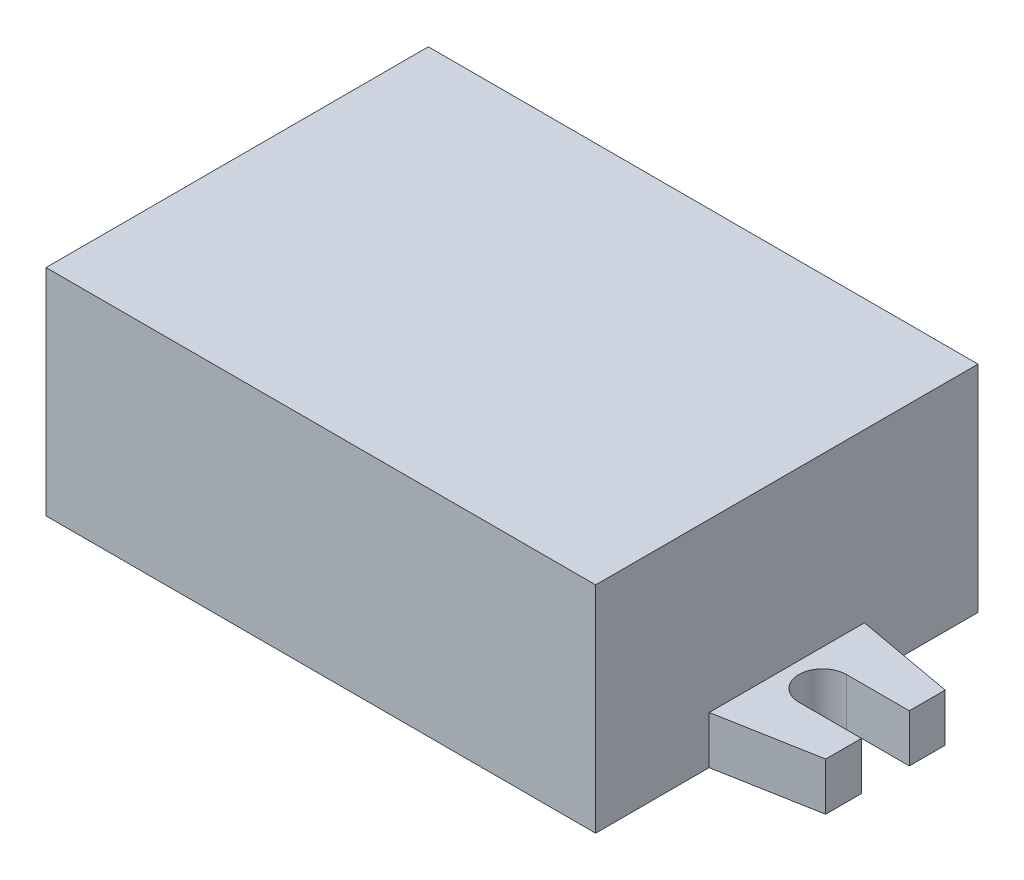
ISO-10303-21;
HEADER;
FILE_DESCRIPTION(('STEP AP214'),'2;1');
FILE_NAME('part.step','',(''),(''),'','','');
FILE_SCHEMA(('AUTOMOTIVE_DESIGN { 1 0 10303 214 1 1 1 1 }'));
ENDSEC;
DATA;
#1=APPLICATION_CONTEXT('core data for automotive mechanical design processes');
#2=APPLICATION_PROTOCOL_DEFINITION('international standard','automotive_design',2000,#1);
#3=PRODUCT_CONTEXT('',#1,'mechanical');
#4=PRODUCT('Part','Part','',(#3));
#5=PRODUCT_RELATED_PRODUCT_CATEGORY('part','',(#4));
#6=PRODUCT_DEFINITION_FORMATION('','',#4);
#7=PRODUCT_DEFINITION_CONTEXT('part definition',#1,'design');
#8=PRODUCT_DEFINITION('design','',#6,#7);
#9=PRODUCT_DEFINITION_SHAPE('','',#8);
#10=(LENGTH_UNIT() NAMED_UNIT(*) SI_UNIT(.MILLI.,.METRE.));
#11=(NAMED_UNIT(*) PLANE_ANGLE_UNIT() SI_UNIT($,.RADIAN.));
#12=(NAMED_UNIT(*) SI_UNIT($,.STERADIAN.) SOLID_ANGLE_UNIT());
#13=UNCERTAINTY_MEASURE_WITH_UNIT(LENGTH_MEASURE(1.E-05),#10,'distance_accuracy_value','');
#14=(GEOMETRIC_REPRESENTATION_CONTEXT(3) GLOBAL_UNCERTAINTY_ASSIGNED_CONTEXT((#13)) GLOBAL_UNIT_ASSIGNED_CONTEXT((#10,
#11,#12)) REPRESENTATION_CONTEXT('',''));
#15=CARTESIAN_POINT('',(0.,0.,0.));
#16=DIRECTION('',(0.,0.,1.));
#17=DIRECTION('',(1.,0.,0.));
#18=AXIS2_PLACEMENT_3D('',#15,#16,#17);
#19=CARTESIAN_POINT('',(-23.,18.,-16.));
#20=DIRECTION('',(1.,0.,0.));
#21=DIRECTION('',(0.,0.,-1.));
#22=AXIS2_PLACEMENT_3D('',#19,#20,#21);
#23=PLANE('',#22);
#24=DIRECTION('',(0.,-1.,0.));
#25=VECTOR('',#24,1.);
#26=CARTESIAN_POINT('',(-23.,4.,-6.5));
#27=LINE('',#26,#25);
#28=CARTESIAN_POINT('',(-23.,4.,-6.5));
#29=VERTEX_POINT('',#28);
#30=CARTESIAN_POINT('',(-23.,0.,-6.5));
#31=VERTEX_POINT('',#30);
#32=EDGE_CURVE('E308',#29,#31,#27,.T.);
#33=ORIENTED_EDGE('',*,*,#32,.F.);
#34=DIRECTION('',(0.,0.,1.));
#35=VECTOR('',#34,1.);
#36=CARTESIAN_POINT('',(-23.,4.,6.5));
#37=LINE('',#36,#35);
#38=CARTESIAN_POINT('',(-23.,4.,6.5));
#39=VERTEX_POINT('',#38);
#40=EDGE_CURVE('E278',#29,#39,#37,.T.);
#41=ORIENTED_EDGE('',*,*,#40,.T.);
#42=DIRECTION('',(0.,-1.,0.));
#43=VECTOR('',#42,1.);
#44=CARTESIAN_POINT('',(-23.,4.,6.5));
#45=LINE('',#44,#43);
#46=CARTESIAN_POINT('',(-23.,0.,6.5));
#47=VERTEX_POINT('',#46);
#48=EDGE_CURVE('E306',#39,#47,#45,.T.);
#49=ORIENTED_EDGE('',*,*,#48,.T.);
#50=DIRECTION('',(0.,0.,1.));
#51=VECTOR('',#50,1.);
#52=CARTESIAN_POINT('',(-23.,0.,-16.));
#53=LINE('',#52,#51);
#54=CARTESIAN_POINT('',(-23.,0.,16.));
#55=VERTEX_POINT('',#54);
#56=EDGE_CURVE('E330',#47,#55,#53,.T.);
#57=ORIENTED_EDGE('',*,*,#56,.T.);
#58=DIRECTION('',(0.,-1.,0.));
#59=VECTOR('',#58,1.);
#60=CARTESIAN_POINT('',(-23.,18.,16.));
#61=LINE('',#60,#59);
#62=CARTESIAN_POINT('',(-23.,18.,16.));
#63=VERTEX_POINT('',#62);
#64=EDGE_CURVE('E51',#63,#55,#61,.T.);
#65=ORIENTED_EDGE('',*,*,#64,.F.);
#66=DIRECTION('',(0.,0.,1.));
#67=VECTOR('',#66,1.);
#68=CARTESIAN_POINT('',(-23.,18.,-16.));
#69=LINE('',#68,#67);
#70=CARTESIAN_POINT('',(-23.,18.,-16.));
#71=VERTEX_POINT('',#70);
#72=EDGE_CURVE('E324',#71,#63,#69,.T.);
#73=ORIENTED_EDGE('',*,*,#72,.F.);
#74=DIRECTION('',(0.,-1.,0.));
#75=VECTOR('',#74,1.);
#76=CARTESIAN_POINT('',(-23.,18.,-16.));
#77=LINE('',#76,#75);
#78=CARTESIAN_POINT('',(-23.,0.,-16.));
#79=VERTEX_POINT('',#78);
#80=EDGE_CURVE('E11',#71,#79,#77,.T.);
#81=ORIENTED_EDGE('',*,*,#80,.T.);
#82=EDGE_CURVE('E322',#79,#31,#53,.T.);
#83=ORIENTED_EDGE('',*,*,#82,.T.);
#84=EDGE_LOOP('',(#33,#41,#49,#57,#65,#73,#81,#83));
#85=FACE_BOUND('',#84,.T.);
#86=ADVANCED_FACE('F43',(#85),#23,.F.);
#87=CARTESIAN_POINT('',(-23.,18.,16.));
#88=DIRECTION('',(0.,0.,-1.));
#89=DIRECTION('',(-1.,0.,0.));
#90=AXIS2_PLACEMENT_3D('',#87,#88,#89);
#91=PLANE('',#90);
#92=DIRECTION('',(1.,0.,0.));
#93=VECTOR('',#92,1.);
#94=CARTESIAN_POINT('',(-23.,0.,16.));
#95=LINE('',#94,#93);
#96=CARTESIAN_POINT('',(23.,0.,16.));
#97=VERTEX_POINT('',#96);
#98=EDGE_CURVE('E305',#55,#97,#95,.T.);
#99=ORIENTED_EDGE('',*,*,#98,.T.);
#100=DIRECTION('',(0.,-1.,0.));
#101=VECTOR('',#100,1.);
#102=CARTESIAN_POINT('',(23.,18.,16.));
#103=LINE('',#102,#101);
#104=CARTESIAN_POINT('',(23.,18.,16.));
#105=VERTEX_POINT('',#104);
#106=EDGE_CURVE('E256',#105,#97,#103,.T.);
#107=ORIENTED_EDGE('',*,*,#106,.F.);
#108=DIRECTION('',(1.,0.,0.));
#109=VECTOR('',#108,1.);
#110=CARTESIAN_POINT('',(-23.,18.,16.));
#111=LINE('',#110,#109);
#112=EDGE_CURVE('E319',#63,#105,#111,.T.);
#113=ORIENTED_EDGE('',*,*,#112,.F.);
#114=ORIENTED_EDGE('',*,*,#64,.T.);
#115=EDGE_LOOP('',(#99,#107,#113,#114));
#116=FACE_BOUND('',#115,.T.);
#117=ADVANCED_FACE('F45',(#116),#91,.F.);
#118=CARTESIAN_POINT('',(0.,18.,-16.));
#119=DIRECTION('',(0.,0.,1.));
#120=DIRECTION('',(1.,0.,0.));
#121=AXIS2_PLACEMENT_3D('',#118,#119,#120);
#122=PLANE('',#121);
#123=DIRECTION('',(-1.,0.,0.));
#124=VECTOR('',#123,1.);
#125=CARTESIAN_POINT('',(0.,0.,-16.));
#126=LINE('',#125,#124);
#127=CARTESIAN_POINT('',(23.,0.,-16.));
#128=VERTEX_POINT('',#127);
#129=EDGE_CURVE('E328',#128,#79,#126,.T.);
#130=ORIENTED_EDGE('',*,*,#129,.T.);
#131=ORIENTED_EDGE('',*,*,#80,.F.);
#132=DIRECTION('',(-1.,0.,0.));
#133=VECTOR('',#132,1.);
#134=CARTESIAN_POINT('',(0.,18.,-16.));
#135=LINE('',#134,#133);
#136=CARTESIAN_POINT('',(23.,18.,-16.));
#137=VERTEX_POINT('',#136);
#138=EDGE_CURVE('E321',#137,#71,#135,.T.);
#139=ORIENTED_EDGE('',*,*,#138,.F.);
#140=DIRECTION('',(0.,-1.,0.));
#141=VECTOR('',#140,1.);
#142=CARTESIAN_POINT('',(23.,18.,-16.));
#143=LINE('',#142,#141);
#144=EDGE_CURVE('E250',#137,#128,#143,.T.);
#145=ORIENTED_EDGE('',*,*,#144,.T.);
#146=EDGE_LOOP('',(#130,#131,#139,#145));
#147=FACE_BOUND('',#146,.T.);
#148=ADVANCED_FACE('F397',(#147),#122,.F.);
#149=CARTESIAN_POINT('',(0.,18.,0.));
#150=DIRECTION('',(0.,1.,0.));
#151=DIRECTION('',(0.,0.,1.));
#152=AXIS2_PLACEMENT_3D('',#149,#150,#151);
#153=PLANE('',#152);
#154=ORIENTED_EDGE('',*,*,#112,.T.);
#155=DIRECTION('',(0.,0.,1.));
#156=VECTOR('',#155,1.);
#157=CARTESIAN_POINT('',(23.,18.,-16.));
#158=LINE('',#157,#156);
#159=EDGE_CURVE('E247',#137,#105,#158,.T.);
#160=ORIENTED_EDGE('',*,*,#159,.F.);
#161=ORIENTED_EDGE('',*,*,#138,.T.);
#162=ORIENTED_EDGE('',*,*,#72,.T.);
#163=EDGE_LOOP('',(#154,#160,#161,#162));
#164=FACE_BOUND('',#163,.T.);
#165=ADVANCED_FACE('F350',(#164),#153,.T.);
#166=CARTESIAN_POINT('',(0.,0.,0.));
#167=DIRECTION('',(0.,1.,0.));
#168=DIRECTION('',(0.,0.,1.));
#169=AXIS2_PLACEMENT_3D('',#166,#167,#168);
#170=PLANE('',#169);
#171=ORIENTED_EDGE('',*,*,#98,.F.);
#172=ORIENTED_EDGE('',*,*,#56,.F.);
#173=DIRECTION('',(-0.983869910099907,0.,-0.178885438199984));
#174=VECTOR('',#173,1.);
#175=CARTESIAN_POINT('',(-31.25,0.,5.));
#176=LINE('',#175,#174);
#177=CARTESIAN_POINT('',(-31.25,0.,5.));
#178=VERTEX_POINT('',#177);
#179=EDGE_CURVE('E66',#47,#178,#176,.T.);
#180=ORIENTED_EDGE('',*,*,#179,.T.);
#181=DIRECTION('',(0.,0.,-1.));
#182=VECTOR('',#181,1.);
#183=CARTESIAN_POINT('',(-31.25,0.,2.));
#184=LINE('',#183,#182);
#185=CARTESIAN_POINT('',(-31.25,0.,2.));
#186=VERTEX_POINT('',#185);
#187=EDGE_CURVE('E259',#178,#186,#184,.T.);
#188=ORIENTED_EDGE('',*,*,#187,.T.);
#189=DIRECTION('',(1.,0.,0.));
#190=VECTOR('',#189,1.);
#191=CARTESIAN_POINT('',(-31.25,0.,2.));
#192=LINE('',#191,#190);
#193=CARTESIAN_POINT('',(-26.,0.,1.99999999999999));
#194=VERTEX_POINT('',#193);
#195=EDGE_CURVE('E287',#186,#194,#192,.T.);
#196=ORIENTED_EDGE('',*,*,#195,.T.);
#197=CARTESIAN_POINT('',(-26.,0.,0.));
#198=DIRECTION('',(0.,1.,0.));
#199=DIRECTION('',(0.,0.,1.));
#200=AXIS2_PLACEMENT_3D('',#197,#198,#199);
#201=CIRCLE('',#200,2.);
#202=CARTESIAN_POINT('',(-26.,0.,-2.));
#203=VERTEX_POINT('',#202);
#204=EDGE_CURVE('E290',#194,#203,#201,.T.);
#205=ORIENTED_EDGE('',*,*,#204,.T.);
#206=DIRECTION('',(-1.,0.,0.));
#207=VECTOR('',#206,1.);
#208=CARTESIAN_POINT('',(-31.25,0.,-2.));
#209=LINE('',#208,#207);
#210=CARTESIAN_POINT('',(-31.25,0.,-2.));
#211=VERTEX_POINT('',#210);
#212=EDGE_CURVE('E293',#203,#211,#209,.T.);
#213=ORIENTED_EDGE('',*,*,#212,.T.);
#214=DIRECTION('',(0.,0.,-1.));
#215=VECTOR('',#214,1.);
#216=CARTESIAN_POINT('',(-31.25,0.,-5.));
#217=LINE('',#216,#215);
#218=CARTESIAN_POINT('',(-31.25,0.,-5.));
#219=VERTEX_POINT('',#218);
#220=EDGE_CURVE('E296',#211,#219,#217,.T.);
#221=ORIENTED_EDGE('',*,*,#220,.T.);
#222=DIRECTION('',(0.983869910099908,0.,-0.178885438199982));
#223=VECTOR('',#222,1.);
#224=CARTESIAN_POINT('',(-31.25,0.,-5.));
#225=LINE('',#224,#223);
#226=EDGE_CURVE('E299',#219,#31,#225,.T.);
#227=ORIENTED_EDGE('',*,*,#226,.T.);
#228=ORIENTED_EDGE('',*,*,#82,.F.);
#229=ORIENTED_EDGE('',*,*,#129,.F.);
#230=DIRECTION('',(0.,0.,1.));
#231=VECTOR('',#230,1.);
#232=CARTESIAN_POINT('',(23.,0.,-16.));
#233=LINE('',#232,#231);
#234=CARTESIAN_POINT('',(23.,0.,-6.5));
#235=VERTEX_POINT('',#234);
#236=EDGE_CURVE('E251',#128,#235,#233,.T.);
#237=ORIENTED_EDGE('',*,*,#236,.T.);
#238=DIRECTION('',(-0.983869910099908,0.,-0.178885438199982));
#239=VECTOR('',#238,1.);
#240=CARTESIAN_POINT('',(31.25,0.,-5.00000000000001));
#241=LINE('',#240,#239);
#242=CARTESIAN_POINT('',(31.25,0.,-5.00000000000001));
#243=VERTEX_POINT('',#242);
#244=EDGE_CURVE('E58',#243,#235,#241,.T.);
#245=ORIENTED_EDGE('',*,*,#244,.F.);
#246=DIRECTION('',(0.,0.,-1.));
#247=VECTOR('',#246,1.);
#248=CARTESIAN_POINT('',(31.25,0.,-5.00000000000001));
#249=LINE('',#248,#247);
#250=CARTESIAN_POINT('',(31.25,0.,-2.00000000000001));
#251=VERTEX_POINT('',#250);
#252=EDGE_CURVE('E226',#251,#243,#249,.T.);
#253=ORIENTED_EDGE('',*,*,#252,.F.);
#254=DIRECTION('',(1.,0.,0.));
#255=VECTOR('',#254,1.);
#256=CARTESIAN_POINT('',(31.25,0.,-2.00000000000001));
#257=LINE('',#256,#255);
#258=CARTESIAN_POINT('',(26.,0.,-2.00000000000001));
#259=VERTEX_POINT('',#258);
#260=EDGE_CURVE('E228',#259,#251,#257,.T.);
#261=ORIENTED_EDGE('',*,*,#260,.F.);
#262=CARTESIAN_POINT('',(26.,0.,0.));
#263=DIRECTION('',(0.,-1.,0.));
#264=DIRECTION('',(0.,0.,1.));
#265=AXIS2_PLACEMENT_3D('',#262,#263,#264);
#266=CIRCLE('',#265,2.);
#267=CARTESIAN_POINT('',(26.,0.,1.99999999999999));
#268=VERTEX_POINT('',#267);
#269=EDGE_CURVE('E209',#268,#259,#266,.T.);
#270=ORIENTED_EDGE('',*,*,#269,.F.);
#271=DIRECTION('',(-1.,0.,0.));
#272=VECTOR('',#271,1.);
#273=CARTESIAN_POINT('',(31.25,0.,1.99999999999999));
#274=LINE('',#273,#272);
#275=CARTESIAN_POINT('',(31.25,0.,1.99999999999999));
#276=VERTEX_POINT('',#275);
#277=EDGE_CURVE('E207',#276,#268,#274,.T.);
#278=ORIENTED_EDGE('',*,*,#277,.F.);
#279=DIRECTION('',(0.,0.,-1.));
#280=VECTOR('',#279,1.);
#281=CARTESIAN_POINT('',(31.25,0.,1.99999999999999));
#282=LINE('',#281,#280);
#283=CARTESIAN_POINT('',(31.25,0.,4.99999999999999));
#284=VERTEX_POINT('',#283);
#285=EDGE_CURVE('E222',#284,#276,#282,.T.);
#286=ORIENTED_EDGE('',*,*,#285,.F.);
#287=DIRECTION('',(0.983869910099907,0.,-0.178885438199984));
#288=VECTOR('',#287,1.);
#289=CARTESIAN_POINT('',(31.25,0.,4.99999999999999));
#290=LINE('',#289,#288);
#291=CARTESIAN_POINT('',(23.,0.,6.5));
#292=VERTEX_POINT('',#291);
#293=EDGE_CURVE('E197',#292,#284,#290,.T.);
#294=ORIENTED_EDGE('',*,*,#293,.F.);
#295=EDGE_CURVE('E232',#292,#97,#233,.T.);
#296=ORIENTED_EDGE('',*,*,#295,.T.);
#297=EDGE_LOOP('',(#171,#172,#180,#188,#196,#205,#213,#221,#227,#228,#229,#237,#245,#253,#261,
#270,#278,#286,#294,#296));
#298=FACE_BOUND('',#297,.T.);
#299=ADVANCED_FACE('F342',(#298),#170,.F.);
#300=CARTESIAN_POINT('',(-31.25,4.,2.));
#301=DIRECTION('',(-1.,0.,0.));
#302=DIRECTION('',(0.,0.,1.));
#303=AXIS2_PLACEMENT_3D('',#300,#301,#302);
#304=PLANE('',#303);
#305=ORIENTED_EDGE('',*,*,#187,.F.);
#306=DIRECTION('',(0.,-1.,0.));
#307=VECTOR('',#306,1.);
#308=CARTESIAN_POINT('',(-31.25,4.,5.));
#309=LINE('',#308,#307);
#310=CARTESIAN_POINT('',(-31.25,4.,5.));
#311=VERTEX_POINT('',#310);
#312=EDGE_CURVE('E303',#311,#178,#309,.T.);
#313=ORIENTED_EDGE('',*,*,#312,.F.);
#314=DIRECTION('',(0.,0.,-1.));
#315=VECTOR('',#314,1.);
#316=CARTESIAN_POINT('',(-31.25,4.,2.));
#317=LINE('',#316,#315);
#318=CARTESIAN_POINT('',(-31.25,4.,2.));
#319=VERTEX_POINT('',#318);
#320=EDGE_CURVE('E260',#311,#319,#317,.T.);
#321=ORIENTED_EDGE('',*,*,#320,.T.);
#322=DIRECTION('',(0.,-1.,0.));
#323=VECTOR('',#322,1.);
#324=CARTESIAN_POINT('',(-31.25,4.,2.));
#325=LINE('',#324,#323);
#326=EDGE_CURVE('E284',#319,#186,#325,.T.);
#327=ORIENTED_EDGE('',*,*,#326,.T.);
#328=EDGE_LOOP('',(#305,#313,#321,#327));
#329=FACE_BOUND('',#328,.T.);
#330=ADVANCED_FACE('F369',(#329),#304,.T.);
#331=CARTESIAN_POINT('',(-31.25,4.,5.));
#332=DIRECTION('',(-0.178885438199984,0.,0.983869910099907));
#333=DIRECTION('',(0.983869910099907,0.,0.178885438199984));
#334=AXIS2_PLACEMENT_3D('',#331,#332,#333);
#335=PLANE('',#334);
#336=ORIENTED_EDGE('',*,*,#179,.F.);
#337=ORIENTED_EDGE('',*,*,#48,.F.);
#338=DIRECTION('',(-0.983869910099907,0.,-0.178885438199984));
#339=VECTOR('',#338,1.);
#340=CARTESIAN_POINT('',(-31.25,4.,5.));
#341=LINE('',#340,#339);
#342=EDGE_CURVE('E281',#39,#311,#341,.T.);
#343=ORIENTED_EDGE('',*,*,#342,.T.);
#344=ORIENTED_EDGE('',*,*,#312,.T.);
#345=EDGE_LOOP('',(#336,#337,#343,#344));
#346=FACE_BOUND('',#345,.T.);
#347=ADVANCED_FACE('F366',(#346),#335,.T.);
#348=CARTESIAN_POINT('',(-31.25,4.,-5.));
#349=DIRECTION('',(-0.178885438199982,0.,-0.983869910099908));
#350=DIRECTION('',(-0.983869910099908,0.,0.178885438199982));
#351=AXIS2_PLACEMENT_3D('',#348,#349,#350);
#352=PLANE('',#351);
#353=ORIENTED_EDGE('',*,*,#226,.F.);
#354=DIRECTION('',(0.,-1.,0.));
#355=VECTOR('',#354,1.);
#356=CARTESIAN_POINT('',(-31.25,4.,-5.));
#357=LINE('',#356,#355);
#358=CARTESIAN_POINT('',(-31.25,4.,-5.));
#359=VERTEX_POINT('',#358);
#360=EDGE_CURVE('E310',#359,#219,#357,.T.);
#361=ORIENTED_EDGE('',*,*,#360,.F.);
#362=DIRECTION('',(0.983869910099908,0.,-0.178885438199982));
#363=VECTOR('',#362,1.);
#364=CARTESIAN_POINT('',(-31.25,4.,-5.));
#365=LINE('',#364,#363);
#366=EDGE_CURVE('E275',#359,#29,#365,.T.);
#367=ORIENTED_EDGE('',*,*,#366,.T.);
#368=ORIENTED_EDGE('',*,*,#32,.T.);
#369=EDGE_LOOP('',(#353,#361,#367,#368));
#370=FACE_BOUND('',#369,.T.);
#371=ADVANCED_FACE('F358',(#370),#352,.T.);
#372=CARTESIAN_POINT('',(-31.25,4.,-5.));
#373=DIRECTION('',(-1.,0.,0.));
#374=DIRECTION('',(0.,0.,1.));
#375=AXIS2_PLACEMENT_3D('',#372,#373,#374);
#376=PLANE('',#375);
#377=ORIENTED_EDGE('',*,*,#220,.F.);
#378=DIRECTION('',(0.,-1.,0.));
#379=VECTOR('',#378,1.);
#380=CARTESIAN_POINT('',(-31.25,4.,-2.));
#381=LINE('',#380,#379);
#382=CARTESIAN_POINT('',(-31.25,4.,-2.));
#383=VERTEX_POINT('',#382);
#384=EDGE_CURVE('E312',#383,#211,#381,.T.);
#385=ORIENTED_EDGE('',*,*,#384,.F.);
#386=DIRECTION('',(0.,0.,-1.));
#387=VECTOR('',#386,1.);
#388=CARTESIAN_POINT('',(-31.25,4.,-5.));
#389=LINE('',#388,#387);
#390=EDGE_CURVE('E272',#383,#359,#389,.T.);
#391=ORIENTED_EDGE('',*,*,#390,.T.);
#392=ORIENTED_EDGE('',*,*,#360,.T.);
#393=EDGE_LOOP('',(#377,#385,#391,#392));
#394=FACE_BOUND('',#393,.T.);
#395=ADVANCED_FACE('F382',(#394),#376,.T.);
#396=CARTESIAN_POINT('',(-31.25,4.,-2.));
#397=DIRECTION('',(0.,0.,1.));
#398=DIRECTION('',(1.,0.,0.));
#399=AXIS2_PLACEMENT_3D('',#396,#397,#398);
#400=PLANE('',#399);
#401=ORIENTED_EDGE('',*,*,#212,.F.);
#402=DIRECTION('',(0.,-1.,0.));
#403=VECTOR('',#402,1.);
#404=CARTESIAN_POINT('',(-26.,4.,-2.));
#405=LINE('',#404,#403);
#406=CARTESIAN_POINT('',(-26.,4.,-2.));
#407=VERTEX_POINT('',#406);
#408=EDGE_CURVE('E314',#407,#203,#405,.T.);
#409=ORIENTED_EDGE('',*,*,#408,.F.);
#410=DIRECTION('',(-1.,0.,0.));
#411=VECTOR('',#410,1.);
#412=CARTESIAN_POINT('',(-31.25,4.,-2.));
#413=LINE('',#412,#411);
#414=EDGE_CURVE('E269',#407,#383,#413,.T.);
#415=ORIENTED_EDGE('',*,*,#414,.T.);
#416=ORIENTED_EDGE('',*,*,#384,.T.);
#417=EDGE_LOOP('',(#401,#409,#415,#416));
#418=FACE_BOUND('',#417,.T.);
#419=ADVANCED_FACE('F380',(#418),#400,.T.);
#420=CARTESIAN_POINT('',(-26.,4.,0.));
#421=DIRECTION('',(0.,-1.,0.));
#422=DIRECTION('',(0.,0.,-1.));
#423=AXIS2_PLACEMENT_3D('',#420,#421,#422);
#424=CYLINDRICAL_SURFACE('',#423,2.);
#425=ORIENTED_EDGE('',*,*,#204,.F.);
#426=DIRECTION('',(0.,-1.,0.));
#427=VECTOR('',#426,1.);
#428=CARTESIAN_POINT('',(-26.,4.,1.99999999999999));
#429=LINE('',#428,#427);
#430=CARTESIAN_POINT('',(-26.,4.,1.99999999999999));
#431=VERTEX_POINT('',#430);
#432=EDGE_CURVE('E316',#431,#194,#429,.T.);
#433=ORIENTED_EDGE('',*,*,#432,.F.);
#434=CARTESIAN_POINT('',(-26.,4.,0.));
#435=DIRECTION('',(0.,1.,0.));
#436=DIRECTION('',(0.,0.,1.));
#437=AXIS2_PLACEMENT_3D('',#434,#435,#436);
#438=CIRCLE('',#437,2.);
#439=EDGE_CURVE('E266',#431,#407,#438,.T.);
#440=ORIENTED_EDGE('',*,*,#439,.T.);
#441=ORIENTED_EDGE('',*,*,#408,.T.);
#442=EDGE_LOOP('',(#425,#433,#440,#441));
#443=FACE_BOUND('',#442,.T.);
#444=ADVANCED_FACE('F376',(#443),#424,.F.);
#445=CARTESIAN_POINT('',(-31.25,4.,2.));
#446=DIRECTION('',(0.,0.,-1.));
#447=DIRECTION('',(-1.,0.,0.));
#448=AXIS2_PLACEMENT_3D('',#445,#446,#447);
#449=PLANE('',#448);
#450=ORIENTED_EDGE('',*,*,#195,.F.);
#451=ORIENTED_EDGE('',*,*,#326,.F.);
#452=DIRECTION('',(1.,0.,0.));
#453=VECTOR('',#452,1.);
#454=CARTESIAN_POINT('',(-31.25,4.,2.));
#455=LINE('',#454,#453);
#456=EDGE_CURVE('E263',#319,#431,#455,.T.);
#457=ORIENTED_EDGE('',*,*,#456,.T.);
#458=ORIENTED_EDGE('',*,*,#432,.T.);
#459=EDGE_LOOP('',(#450,#451,#457,#458));
#460=FACE_BOUND('',#459,.T.);
#461=ADVANCED_FACE('F373',(#460),#449,.T.);
#462=CARTESIAN_POINT('',(-26.,4.,0.));
#463=DIRECTION('',(0.,1.,0.));
#464=DIRECTION('',(0.,0.,1.));
#465=AXIS2_PLACEMENT_3D('',#462,#463,#464);
#466=PLANE('',#465);
#467=ORIENTED_EDGE('',*,*,#320,.F.);
#468=ORIENTED_EDGE('',*,*,#342,.F.);
#469=ORIENTED_EDGE('',*,*,#40,.F.);
#470=ORIENTED_EDGE('',*,*,#366,.F.);
#471=ORIENTED_EDGE('',*,*,#390,.F.);
#472=ORIENTED_EDGE('',*,*,#414,.F.);
#473=ORIENTED_EDGE('',*,*,#439,.F.);
#474=ORIENTED_EDGE('',*,*,#456,.F.);
#475=EDGE_LOOP('',(#467,#468,#469,#470,#471,#472,#473,#474));
#476=FACE_BOUND('',#475,.T.);
#477=ADVANCED_FACE('F363',(#476),#466,.T.);
#478=CARTESIAN_POINT('',(23.,18.,-16.));
#479=DIRECTION('',(1.,0.,0.));
#480=DIRECTION('',(0.,0.,-1.));
#481=AXIS2_PLACEMENT_3D('',#478,#479,#480);
#482=PLANE('',#481);
#483=DIRECTION('',(0.,-1.,0.));
#484=VECTOR('',#483,1.);
#485=CARTESIAN_POINT('',(23.,4.,6.5));
#486=LINE('',#485,#484);
#487=CARTESIAN_POINT('',(23.,4.,6.5));
#488=VERTEX_POINT('',#487);
#489=EDGE_CURVE('E201',#488,#292,#486,.T.);
#490=ORIENTED_EDGE('',*,*,#489,.F.);
#491=DIRECTION('',(0.,0.,1.));
#492=VECTOR('',#491,1.);
#493=CARTESIAN_POINT('',(23.,4.,6.5));
#494=LINE('',#493,#492);
#495=CARTESIAN_POINT('',(23.,4.,-6.5));
#496=VERTEX_POINT('',#495);
#497=EDGE_CURVE('E189',#496,#488,#494,.T.);
#498=ORIENTED_EDGE('',*,*,#497,.F.);
#499=DIRECTION('',(0.,-1.,0.));
#500=VECTOR('',#499,1.);
#501=CARTESIAN_POINT('',(23.,4.,-6.5));
#502=LINE('',#501,#500);
#503=EDGE_CURVE('E244',#496,#235,#502,.T.);
#504=ORIENTED_EDGE('',*,*,#503,.T.);
#505=ORIENTED_EDGE('',*,*,#236,.F.);
#506=ORIENTED_EDGE('',*,*,#144,.F.);
#507=ORIENTED_EDGE('',*,*,#159,.T.);
#508=ORIENTED_EDGE('',*,*,#106,.T.);
#509=ORIENTED_EDGE('',*,*,#295,.F.);
#510=EDGE_LOOP('',(#490,#498,#504,#505,#506,#507,#508,#509));
#511=FACE_BOUND('',#510,.T.);
#512=ADVANCED_FACE('F345',(#511),#482,.T.);
#513=CARTESIAN_POINT('',(31.25,4.,1.99999999999999));
#514=DIRECTION('',(-1.,0.,0.));
#515=DIRECTION('',(0.,0.,1.));
#516=AXIS2_PLACEMENT_3D('',#513,#514,#515);
#517=PLANE('',#516);
#518=ORIENTED_EDGE('',*,*,#285,.T.);
#519=DIRECTION('',(0.,-1.,0.));
#520=VECTOR('',#519,1.);
#521=CARTESIAN_POINT('',(31.25,4.,1.99999999999999));
#522=LINE('',#521,#520);
#523=CARTESIAN_POINT('',(31.25,4.,1.99999999999999));
#524=VERTEX_POINT('',#523);
#525=EDGE_CURVE('E206',#524,#276,#522,.T.);
#526=ORIENTED_EDGE('',*,*,#525,.F.);
#527=DIRECTION('',(0.,0.,-1.));
#528=VECTOR('',#527,1.);
#529=CARTESIAN_POINT('',(31.25,4.,1.99999999999999));
#530=LINE('',#529,#528);
#531=CARTESIAN_POINT('',(31.25,4.,4.99999999999999));
#532=VERTEX_POINT('',#531);
#533=EDGE_CURVE('E186',#532,#524,#530,.T.);
#534=ORIENTED_EDGE('',*,*,#533,.F.);
#535=DIRECTION('',(0.,-1.,0.));
#536=VECTOR('',#535,1.);
#537=CARTESIAN_POINT('',(31.25,4.,4.99999999999999));
#538=LINE('',#537,#536);
#539=EDGE_CURVE('E194',#532,#284,#538,.T.);
#540=ORIENTED_EDGE('',*,*,#539,.T.);
#541=EDGE_LOOP('',(#518,#526,#534,#540));
#542=FACE_BOUND('',#541,.T.);
#543=ADVANCED_FACE('F204',(#542),#517,.F.);
#544=CARTESIAN_POINT('',(31.25,4.,1.99999999999999));
#545=DIRECTION('',(0.,0.,1.));
#546=DIRECTION('',(1.,0.,0.));
#547=AXIS2_PLACEMENT_3D('',#544,#545,#546);
#548=PLANE('',#547);
#549=ORIENTED_EDGE('',*,*,#277,.T.);
#550=DIRECTION('',(0.,-1.,0.));
#551=VECTOR('',#550,1.);
#552=CARTESIAN_POINT('',(26.,4.,1.99999999999999));
#553=LINE('',#552,#551);
#554=CARTESIAN_POINT('',(26.,4.,1.99999999999999));
#555=VERTEX_POINT('',#554);
#556=EDGE_CURVE('E233',#555,#268,#553,.T.);
#557=ORIENTED_EDGE('',*,*,#556,.F.);
#558=DIRECTION('',(-1.,0.,0.));
#559=VECTOR('',#558,1.);
#560=CARTESIAN_POINT('',(31.25,4.,1.99999999999999));
#561=LINE('',#560,#559);
#562=EDGE_CURVE('E202',#524,#555,#561,.T.);
#563=ORIENTED_EDGE('',*,*,#562,.F.);
#564=ORIENTED_EDGE('',*,*,#525,.T.);
#565=EDGE_LOOP('',(#549,#557,#563,#564));
#566=FACE_BOUND('',#565,.T.);
#567=ADVANCED_FACE('F423',(#566),#548,.F.);
#568=CARTESIAN_POINT('',(26.,4.,0.));
#569=DIRECTION('',(0.,-1.,0.));
#570=DIRECTION('',(0.,0.,-1.));
#571=AXIS2_PLACEMENT_3D('',#568,#569,#570);
#572=CYLINDRICAL_SURFACE('',#571,2.);
#573=ORIENTED_EDGE('',*,*,#269,.T.);
#574=DIRECTION('',(0.,-1.,0.));
#575=VECTOR('',#574,1.);
#576=CARTESIAN_POINT('',(26.,4.,-2.00000000000001));
#577=LINE('',#576,#575);
#578=CARTESIAN_POINT('',(26.,4.,-2.00000000000001));
#579=VERTEX_POINT('',#578);
#580=EDGE_CURVE('E236',#579,#259,#577,.T.);
#581=ORIENTED_EDGE('',*,*,#580,.F.);
#582=CARTESIAN_POINT('',(26.,4.,0.));
#583=DIRECTION('',(0.,-1.,0.));
#584=DIRECTION('',(0.,0.,1.));
#585=AXIS2_PLACEMENT_3D('',#582,#583,#584);
#586=CIRCLE('',#585,2.);
#587=EDGE_CURVE('E219',#555,#579,#586,.T.);
#588=ORIENTED_EDGE('',*,*,#587,.F.);
#589=ORIENTED_EDGE('',*,*,#556,.T.);
#590=EDGE_LOOP('',(#573,#581,#588,#589));
#591=FACE_BOUND('',#590,.T.);
#592=ADVANCED_FACE('F420',(#591),#572,.F.);
#593=CARTESIAN_POINT('',(31.25,4.,-2.00000000000001));
#594=DIRECTION('',(0.,0.,-1.));
#595=DIRECTION('',(-1.,0.,0.));
#596=AXIS2_PLACEMENT_3D('',#593,#594,#595);
#597=PLANE('',#596);
#598=ORIENTED_EDGE('',*,*,#260,.T.);
#599=DIRECTION('',(0.,-1.,0.));
#600=VECTOR('',#599,1.);
#601=CARTESIAN_POINT('',(31.25,4.,-2.00000000000001));
#602=LINE('',#601,#600);
#603=CARTESIAN_POINT('',(31.25,4.,-2.00000000000001));
#604=VERTEX_POINT('',#603);
#605=EDGE_CURVE('E239',#604,#251,#602,.T.);
#606=ORIENTED_EDGE('',*,*,#605,.F.);
#607=DIRECTION('',(1.,0.,0.));
#608=VECTOR('',#607,1.);
#609=CARTESIAN_POINT('',(31.25,4.,-2.00000000000001));
#610=LINE('',#609,#608);
#611=EDGE_CURVE('E217',#579,#604,#610,.T.);
#612=ORIENTED_EDGE('',*,*,#611,.F.);
#613=ORIENTED_EDGE('',*,*,#580,.T.);
#614=EDGE_LOOP('',(#598,#606,#612,#613));
#615=FACE_BOUND('',#614,.T.);
#616=ADVANCED_FACE('F418',(#615),#597,.F.);
#617=CARTESIAN_POINT('',(31.25,4.,-5.00000000000001));
#618=DIRECTION('',(-1.,0.,0.));
#619=DIRECTION('',(0.,0.,1.));
#620=AXIS2_PLACEMENT_3D('',#617,#618,#619);
#621=PLANE('',#620);
#622=ORIENTED_EDGE('',*,*,#252,.T.);
#623=DIRECTION('',(0.,-1.,0.));
#624=VECTOR('',#623,1.);
#625=CARTESIAN_POINT('',(31.25,4.,-5.00000000000001));
#626=LINE('',#625,#624);
#627=CARTESIAN_POINT('',(31.25,4.,-5.00000000000001));
#628=VERTEX_POINT('',#627);
#629=EDGE_CURVE('E242',#628,#243,#626,.T.);
#630=ORIENTED_EDGE('',*,*,#629,.F.);
#631=DIRECTION('',(0.,0.,-1.));
#632=VECTOR('',#631,1.);
#633=CARTESIAN_POINT('',(31.25,4.,-5.00000000000001));
#634=LINE('',#633,#632);
#635=EDGE_CURVE('E215',#604,#628,#634,.T.);
#636=ORIENTED_EDGE('',*,*,#635,.F.);
#637=ORIENTED_EDGE('',*,*,#605,.T.);
#638=EDGE_LOOP('',(#622,#630,#636,#637));
#639=FACE_BOUND('',#638,.T.);
#640=ADVANCED_FACE('F409',(#639),#621,.F.);
#641=CARTESIAN_POINT('',(31.25,4.,-5.00000000000001));
#642=DIRECTION('',(-0.178885438199982,0.,0.983869910099908));
#643=DIRECTION('',(0.983869910099908,0.,0.178885438199982));
#644=AXIS2_PLACEMENT_3D('',#641,#642,#643);
#645=PLANE('',#644);
#646=ORIENTED_EDGE('',*,*,#244,.T.);
#647=ORIENTED_EDGE('',*,*,#503,.F.);
#648=DIRECTION('',(-0.983869910099908,0.,-0.178885438199982));
#649=VECTOR('',#648,1.);
#650=CARTESIAN_POINT('',(31.25,4.,-5.00000000000001));
#651=LINE('',#650,#649);
#652=EDGE_CURVE('E213',#628,#496,#651,.T.);
#653=ORIENTED_EDGE('',*,*,#652,.F.);
#654=ORIENTED_EDGE('',*,*,#629,.T.);
#655=EDGE_LOOP('',(#646,#647,#653,#654));
#656=FACE_BOUND('',#655,.T.);
#657=ADVANCED_FACE('F413',(#656),#645,.F.);
#658=CARTESIAN_POINT('',(31.25,4.,4.99999999999999));
#659=DIRECTION('',(-0.178885438199984,0.,-0.983869910099907));
#660=DIRECTION('',(-0.983869910099907,0.,0.178885438199984));
#661=AXIS2_PLACEMENT_3D('',#658,#659,#660);
#662=PLANE('',#661);
#663=ORIENTED_EDGE('',*,*,#293,.T.);
#664=ORIENTED_EDGE('',*,*,#539,.F.);
#665=DIRECTION('',(0.983869910099907,0.,-0.178885438199984));
#666=VECTOR('',#665,1.);
#667=CARTESIAN_POINT('',(31.25,4.,4.99999999999999));
#668=LINE('',#667,#666);
#669=EDGE_CURVE('E182',#488,#532,#668,.T.);
#670=ORIENTED_EDGE('',*,*,#669,.F.);
#671=ORIENTED_EDGE('',*,*,#489,.T.);
#672=EDGE_LOOP('',(#663,#664,#670,#671));
#673=FACE_BOUND('',#672,.T.);
#674=ADVANCED_FACE('F195',(#673),#662,.F.);
#675=CARTESIAN_POINT('',(26.,4.,0.));
#676=DIRECTION('',(0.,1.,0.));
#677=DIRECTION('',(0.,0.,1.));
#678=AXIS2_PLACEMENT_3D('',#675,#676,#677);
#679=PLANE('',#678);
#680=ORIENTED_EDGE('',*,*,#533,.T.);
#681=ORIENTED_EDGE('',*,*,#562,.T.);
#682=ORIENTED_EDGE('',*,*,#587,.T.);
#683=ORIENTED_EDGE('',*,*,#611,.T.);
#684=ORIENTED_EDGE('',*,*,#635,.T.);
#685=ORIENTED_EDGE('',*,*,#652,.T.);
#686=ORIENTED_EDGE('',*,*,#497,.T.);
#687=ORIENTED_EDGE('',*,*,#669,.T.);
#688=EDGE_LOOP('',(#680,#681,#682,#683,#684,#685,#686,#687));
#689=FACE_BOUND('',#688,.T.);
#690=ADVANCED_FACE('F184',(#689),#679,.T.);
#691=CLOSED_SHELL('',(#86,#117,#148,#165,#299,#330,#347,#371,#395,#419,#444,#461,#477,#512,#543,
#567,#592,#616,#640,#657,#674,#690));
#692=MANIFOLD_SOLID_BREP('B2',#691);
#693=ADVANCED_BREP_SHAPE_REPRESENTATION('',(#18,#692),#14);
#694=SHAPE_DEFINITION_REPRESENTATION(#9,#693);
ENDSEC;
END-ISO-10303-21;
